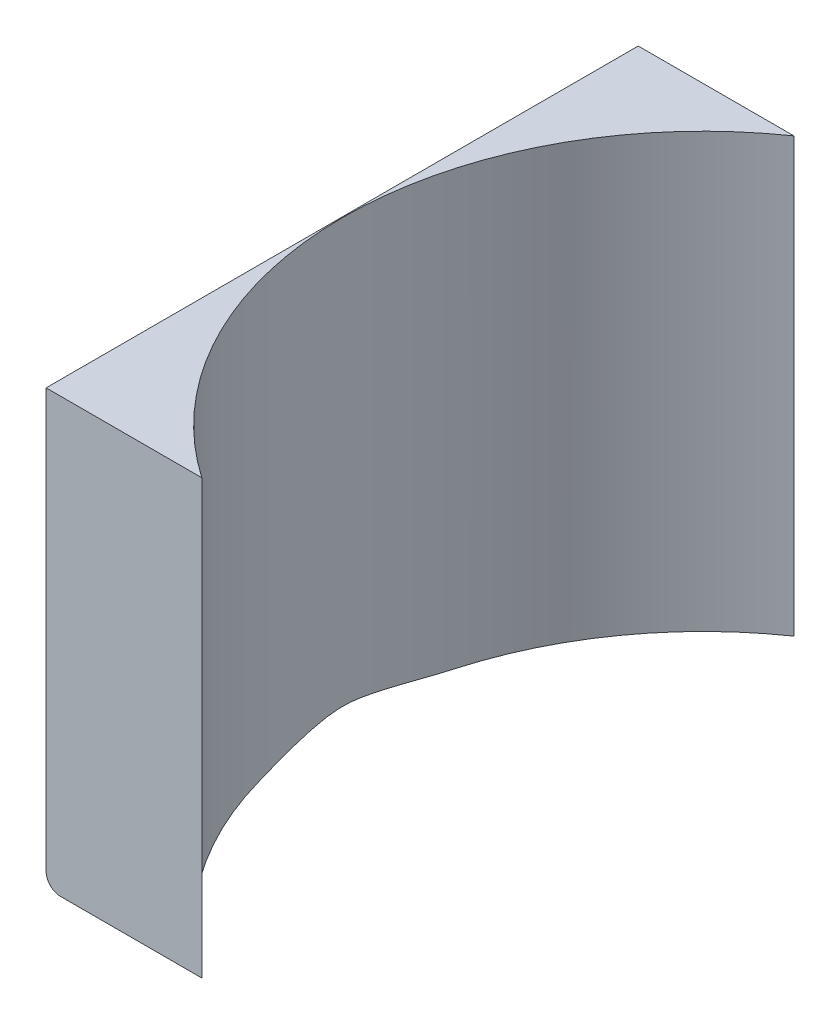
ISO-10303-21;
HEADER;
FILE_DESCRIPTION(('STEP AP214'),'2;1');
FILE_NAME('part.step','',(''),(''),'','','');
FILE_SCHEMA(('AUTOMOTIVE_DESIGN { 1 0 10303 214 1 1 1 1 }'));
ENDSEC;
DATA;
#1=APPLICATION_CONTEXT('core data for automotive mechanical design processes');
#2=APPLICATION_PROTOCOL_DEFINITION('international standard','automotive_design',2000,#1);
#3=PRODUCT_CONTEXT('',#1,'mechanical');
#4=PRODUCT('Part','Part','',(#3));
#5=PRODUCT_RELATED_PRODUCT_CATEGORY('part','',(#4));
#6=PRODUCT_DEFINITION_FORMATION('','',#4);
#7=PRODUCT_DEFINITION_CONTEXT('part definition',#1,'design');
#8=PRODUCT_DEFINITION('design','',#6,#7);
#9=PRODUCT_DEFINITION_SHAPE('','',#8);
#10=(LENGTH_UNIT() NAMED_UNIT(*) SI_UNIT(.MILLI.,.METRE.));
#11=(NAMED_UNIT(*) PLANE_ANGLE_UNIT() SI_UNIT($,.RADIAN.));
#12=(NAMED_UNIT(*) SI_UNIT($,.STERADIAN.) SOLID_ANGLE_UNIT());
#13=UNCERTAINTY_MEASURE_WITH_UNIT(LENGTH_MEASURE(1.E-05),#10,'distance_accuracy_value','');
#14=(GEOMETRIC_REPRESENTATION_CONTEXT(3) GLOBAL_UNCERTAINTY_ASSIGNED_CONTEXT((#13)) GLOBAL_UNIT_ASSIGNED_CONTEXT((#10,
#11,#12)) REPRESENTATION_CONTEXT('',''));
#15=CARTESIAN_POINT('',(0.,0.,0.));
#16=DIRECTION('',(0.,0.,1.));
#17=DIRECTION('',(1.,0.,0.));
#18=AXIS2_PLACEMENT_3D('',#15,#16,#17);
#19=CARTESIAN_POINT('',(0.,0.,0.));
#20=DIRECTION('',(0.,1.,0.));
#21=DIRECTION('',(0.,0.,1.));
#22=AXIS2_PLACEMENT_3D('',#19,#20,#21);
#23=PLANE('',#22);
#24=DIRECTION('',(-1.,0.,0.));
#25=VECTOR('',#24,1.);
#26=CARTESIAN_POINT('',(12.5,0.,-20.5));
#27=LINE('',#26,#25);
#28=CARTESIAN_POINT('',(-1.72155054837552,0.,-20.5));
#29=VERTEX_POINT('',#28);
#30=CARTESIAN_POINT('',(-11.5,0.,-20.5));
#31=VERTEX_POINT('',#30);
#32=EDGE_CURVE('E64',#29,#31,#27,.T.);
#33=ORIENTED_EDGE('',*,*,#32,.F.);
#34=CARTESIAN_POINT('',(12.5,0.,0.));
#35=DIRECTION('',(0.,1.,0.));
#36=DIRECTION('',(0.,0.,1.));
#37=AXIS2_PLACEMENT_3D('',#34,#35,#36);
#38=CIRCLE('',#37,24.95);
#39=CARTESIAN_POINT('',(-11.5,0.,-6.81927415492296));
#40=VERTEX_POINT('',#39);
#41=EDGE_CURVE('E93',#29,#40,#38,.T.);
#42=ORIENTED_EDGE('',*,*,#41,.T.);
#43=DIRECTION('',(0.,0.,1.));
#44=VECTOR('',#43,1.);
#45=CARTESIAN_POINT('',(-11.5,0.,0.));
#46=LINE('',#45,#44);
#47=EDGE_CURVE('E106',#40,#31,#46,.F.);
#48=ORIENTED_EDGE('',*,*,#47,.T.);
#49=EDGE_LOOP('',(#33,#42,#48));
#50=FACE_BOUND('',#49,.T.);
#51=ADVANCED_FACE('F36',(#50),#23,.F.);
#52=CARTESIAN_POINT('',(-12.5,30.,20.5));
#53=DIRECTION('',(1.,0.,0.));
#54=DIRECTION('',(0.,0.,-1.));
#55=AXIS2_PLACEMENT_3D('',#52,#53,#54);
#56=PLANE('',#55);
#57=DIRECTION('',(0.,-1.,0.));
#58=VECTOR('',#57,1.);
#59=CARTESIAN_POINT('',(-12.5,30.,-20.5));
#60=LINE('',#59,#58);
#61=CARTESIAN_POINT('',(-12.5,30.,-20.5));
#62=VERTEX_POINT('',#61);
#63=CARTESIAN_POINT('',(-12.5,1.,-20.5));
#64=VERTEX_POINT('',#63);
#65=EDGE_CURVE('E118',#62,#64,#60,.T.);
#66=ORIENTED_EDGE('',*,*,#65,.T.);
#67=DIRECTION('',(0.,0.,1.));
#68=VECTOR('',#67,1.);
#69=CARTESIAN_POINT('',(-12.5,1.,20.5));
#70=LINE('',#69,#68);
#71=CARTESIAN_POINT('',(-12.5,1.,20.5));
#72=VERTEX_POINT('',#71);
#73=EDGE_CURVE('E124',#64,#72,#70,.T.);
#74=ORIENTED_EDGE('',*,*,#73,.T.);
#75=DIRECTION('',(0.,-1.,0.));
#76=VECTOR('',#75,1.);
#77=CARTESIAN_POINT('',(-12.5,30.,20.5));
#78=LINE('',#77,#76);
#79=CARTESIAN_POINT('',(-12.5,30.,20.5));
#80=VERTEX_POINT('',#79);
#81=EDGE_CURVE('E121',#80,#72,#78,.T.);
#82=ORIENTED_EDGE('',*,*,#81,.F.);
#83=DIRECTION('',(0.,0.,1.));
#84=VECTOR('',#83,1.);
#85=CARTESIAN_POINT('',(-12.5,30.,20.5));
#86=LINE('',#85,#84);
#87=EDGE_CURVE('E108',#62,#80,#86,.T.);
#88=ORIENTED_EDGE('',*,*,#87,.F.);
#89=EDGE_LOOP('',(#66,#74,#82,#88));
#90=FACE_BOUND('',#89,.T.);
#91=ADVANCED_FACE('F135',(#90),#56,.F.);
#92=CARTESIAN_POINT('',(12.5,30.,20.5));
#93=DIRECTION('',(0.,0.,-1.));
#94=DIRECTION('',(-1.,0.,0.));
#95=AXIS2_PLACEMENT_3D('',#92,#93,#94);
#96=PLANE('',#95);
#97=DIRECTION('',(1.,0.,0.));
#98=VECTOR('',#97,1.);
#99=CARTESIAN_POINT('',(12.5,0.,20.5));
#100=LINE('',#99,#98);
#101=CARTESIAN_POINT('',(-11.5,0.,20.5));
#102=VERTEX_POINT('',#101);
#103=CARTESIAN_POINT('',(-1.72155054837554,0.,20.5));
#104=VERTEX_POINT('',#103);
#105=EDGE_CURVE('E109',#102,#104,#100,.T.);
#106=ORIENTED_EDGE('',*,*,#105,.T.);
#107=DIRECTION('',(0.,1.,0.));
#108=VECTOR('',#107,1.);
#109=CARTESIAN_POINT('',(-1.72155054837554,0.,20.5));
#110=LINE('',#109,#108);
#111=CARTESIAN_POINT('',(-1.72155054837554,30.,20.5));
#112=VERTEX_POINT('',#111);
#113=EDGE_CURVE('E104',#104,#112,#110,.T.);
#114=ORIENTED_EDGE('',*,*,#113,.T.);
#115=DIRECTION('',(1.,0.,0.));
#116=VECTOR('',#115,1.);
#117=CARTESIAN_POINT('',(12.5,30.,20.5));
#118=LINE('',#117,#116);
#119=EDGE_CURVE('E112',#80,#112,#118,.T.);
#120=ORIENTED_EDGE('',*,*,#119,.F.);
#121=ORIENTED_EDGE('',*,*,#81,.T.);
#122=CARTESIAN_POINT('',(-11.5,1.,20.5));
#123=DIRECTION('',(0.,0.,-1.));
#124=DIRECTION('',(-1.,0.,0.));
#125=AXIS2_PLACEMENT_3D('',#122,#123,#124);
#126=CIRCLE('',#125,1.);
#127=EDGE_CURVE('E127',#72,#102,#126,.F.);
#128=ORIENTED_EDGE('',*,*,#127,.T.);
#129=EDGE_LOOP('',(#106,#114,#120,#121,#128));
#130=FACE_BOUND('',#129,.T.);
#131=ADVANCED_FACE('F140',(#130),#96,.F.);
#132=CARTESIAN_POINT('',(12.5,30.,-20.5));
#133=DIRECTION('',(0.,0.,1.));
#134=DIRECTION('',(1.,0.,0.));
#135=AXIS2_PLACEMENT_3D('',#132,#133,#134);
#136=PLANE('',#135);
#137=DIRECTION('',(-1.,0.,0.));
#138=VECTOR('',#137,1.);
#139=CARTESIAN_POINT('',(12.5,30.,-20.5));
#140=LINE('',#139,#138);
#141=CARTESIAN_POINT('',(-1.72155054837552,30.,-20.5));
#142=VERTEX_POINT('',#141);
#143=EDGE_CURVE('E103',#142,#62,#140,.T.);
#144=ORIENTED_EDGE('',*,*,#143,.F.);
#145=DIRECTION('',(0.,1.,0.));
#146=VECTOR('',#145,1.);
#147=CARTESIAN_POINT('',(-1.72155054837552,0.,-20.5));
#148=LINE('',#147,#146);
#149=EDGE_CURVE('E95',#142,#29,#148,.F.);
#150=ORIENTED_EDGE('',*,*,#149,.T.);
#151=ORIENTED_EDGE('',*,*,#32,.T.);
#152=CARTESIAN_POINT('',(-11.5,1.,-20.5));
#153=DIRECTION('',(0.,0.,1.));
#154=DIRECTION('',(1.,0.,0.));
#155=AXIS2_PLACEMENT_3D('',#152,#153,#154);
#156=CIRCLE('',#155,1.);
#157=EDGE_CURVE('E50',#31,#64,#156,.F.);
#158=ORIENTED_EDGE('',*,*,#157,.T.);
#159=ORIENTED_EDGE('',*,*,#65,.F.);
#160=EDGE_LOOP('',(#144,#150,#151,#158,#159));
#161=FACE_BOUND('',#160,.T.);
#162=ADVANCED_FACE('F101',(#161),#136,.F.);
#163=CARTESIAN_POINT('',(0.,30.,0.));
#164=DIRECTION('',(0.,1.,0.));
#165=DIRECTION('',(0.,0.,1.));
#166=AXIS2_PLACEMENT_3D('',#163,#164,#165);
#167=PLANE('',#166);
#168=CARTESIAN_POINT('',(12.5,30.,0.));
#169=DIRECTION('',(0.,1.,0.));
#170=DIRECTION('',(0.,0.,1.));
#171=AXIS2_PLACEMENT_3D('',#168,#169,#170);
#172=CIRCLE('',#171,24.95);
#173=EDGE_CURVE('E144',#142,#112,#172,.T.);
#174=ORIENTED_EDGE('',*,*,#173,.F.);
#175=ORIENTED_EDGE('',*,*,#143,.T.);
#176=ORIENTED_EDGE('',*,*,#87,.T.);
#177=ORIENTED_EDGE('',*,*,#119,.T.);
#178=EDGE_LOOP('',(#174,#175,#176,#177));
#179=FACE_BOUND('',#178,.T.);
#180=ADVANCED_FACE('F150',(#179),#167,.T.);
#181=CARTESIAN_POINT('',(-11.5,0.,6.81927415492296));
#182=VERTEX_POINT('',#181);
#183=EDGE_CURVE('E129',#102,#182,#46,.F.);
#184=ORIENTED_EDGE('',*,*,#183,.T.);
#185=EDGE_CURVE('E56',#182,#104,#38,.T.);
#186=ORIENTED_EDGE('',*,*,#185,.T.);
#187=ORIENTED_EDGE('',*,*,#105,.F.);
#188=EDGE_LOOP('',(#184,#186,#187));
#189=FACE_BOUND('',#188,.T.);
#190=ADVANCED_FACE('F143',(#189),#23,.F.);
#191=CARTESIAN_POINT('',(-11.5,1.,20.5));
#192=DIRECTION('',(0.,0.,1.));
#193=DIRECTION('',(1.,0.,0.));
#194=AXIS2_PLACEMENT_3D('',#191,#192,#193);
#195=CYLINDRICAL_SURFACE('',#194,1.);
#196=CARTESIAN_POINT('',(-11.5,0.,6.81927415492296));
#197=CARTESIAN_POINT('',(-11.5457732983895,4.19109116719665E-05,6.65818263210462));
#198=CARTESIAN_POINT('',(-11.5899105626056,0.00313718969765501,6.49667047038361));
#199=CARTESIAN_POINT('',(-11.6748711429704,0.0144676332201106,6.17301172480707));
#200=CARTESIAN_POINT('',(-11.7156956146173,0.022700997014768,6.0108653830175));
#201=CARTESIAN_POINT('',(-11.8329934492836,0.0536126443049659,5.5244033685815));
#202=CARTESIAN_POINT('',(-11.9045134427951,0.0825120988208896,5.19928197341116));
#203=CARTESIAN_POINT('',(-12.0300320609709,0.149254369045573,4.56907130850546));
#204=CARTESIAN_POINT('',(-12.084872734357,0.186385472854514,4.26406822369236));
#205=CARTESIAN_POINT('',(-12.1830728053806,0.266903790794347,3.65297303550817));
#206=CARTESIAN_POINT('',(-12.2264295282701,0.310292458757808,3.34688069523113));
#207=CARTESIAN_POINT('',(-12.2829064307552,0.377172928712937,2.88685626398407));
#208=CARTESIAN_POINT('',(-12.3003111289144,0.399775720813323,2.73330341906113));
#209=CARTESIAN_POINT('',(-12.3322655974969,0.444935034705895,2.42589491954099));
#210=CARTESIAN_POINT('',(-12.3468154381606,0.467491557622964,2.27203927248798));
#211=CARTESIAN_POINT('',(-12.3730590505528,0.511708881529116,1.96400615082411));
#212=CARTESIAN_POINT('',(-12.3847537307286,0.533369965599532,1.8098287943619));
#213=CARTESIAN_POINT('',(-12.4052890310887,0.574583560624603,1.50100822613499));
#214=CARTESIAN_POINT('',(-12.414129924682,0.594136273453602,1.34636506043112));
#215=CARTESIAN_POINT('',(-12.4263321459197,0.623085849142543,1.09112089503728));
#216=CARTESIAN_POINT('',(-12.4305263852323,0.63363262559979,0.990692632531398));
#217=CARTESIAN_POINT('',(-12.4377065739978,0.652430675867184,0.7895718211807));
#218=CARTESIAN_POINT('',(-12.4406924219893,0.660681756903115,0.688879250857638));
#219=CARTESIAN_POINT('',(-12.4478119433998,0.680816167111608,0.386840215600974));
#220=CARTESIAN_POINT('',(-12.4501287384151,0.688137069742008,0.185091638313497));
#221=CARTESIAN_POINT('',(-12.4498661088151,0.687347246399775,-0.209440839261772));
#222=CARTESIAN_POINT('',(-12.447498490006,0.679904040999444,-0.402226987109895));
#223=CARTESIAN_POINT('',(-12.4383285808258,0.654020721582922,-0.786998615243157));
#224=CARTESIAN_POINT('',(-12.4315231788955,0.635572892429963,-0.978983438553836));
#225=CARTESIAN_POINT('',(-12.4135098680592,0.592511915836431,-1.36252906981458));
#226=CARTESIAN_POINT('',(-12.4022901754228,0.567882330752974,-1.55408735120079));
#227=CARTESIAN_POINT('',(-12.3754768691812,0.515851150493839,-1.93645817304113));
#228=CARTESIAN_POINT('',(-12.3598843649432,0.488450259514714,-2.12727089020948));
#229=CARTESIAN_POINT('',(-12.3241956627555,0.432719560358191,-2.50977490337278));
#230=CARTESIAN_POINT('',(-12.3040673968964,0.404384428574507,-2.70146243482344));
#231=CARTESIAN_POINT('',(-12.2593629895779,0.348344379208924,-3.08441419067172));
#232=CARTESIAN_POINT('',(-12.2347865864743,0.320639498807056,-3.27567838949823));
#233=CARTESIAN_POINT('',(-12.1544343375143,0.240091229088246,-3.84835528273055));
#234=CARTESIAN_POINT('',(-12.0919810564746,0.189722367560194,-4.22923581843728));
#235=CARTESIAN_POINT('',(-11.985693966563,0.124916091872307,-4.79467522724649));
#236=CARTESIAN_POINT('',(-11.9486891129527,0.105282349795293,-4.97994637789715));
#237=CARTESIAN_POINT('',(-11.8703858710218,0.0701310749394397,-5.35000607646716));
#238=CARTESIAN_POINT('',(-11.8290869502402,0.0546140534801545,-5.53479456161711));
#239=CARTESIAN_POINT('',(-11.7422882383097,0.028740336755059,-5.90336580015901));
#240=CARTESIAN_POINT('',(-11.6967970866652,0.0183732981850687,-6.08714983023958));
#241=CARTESIAN_POINT('',(-11.6253785585989,0.00759933789655947,-6.36219977229538));
#242=CARTESIAN_POINT('',(-11.6010394556364,0.0048040762665176,-6.45378798219596));
#243=CARTESIAN_POINT('',(-11.5513076038181,0.00100677192785223,-6.63672280486647));
#244=CARTESIAN_POINT('',(-11.525914766412,4.880238336653E-06,-6.72806939664313));
#245=CARTESIAN_POINT('',(-11.5,0.,-6.81927415492296));
#246=B_SPLINE_CURVE_WITH_KNOTS('',3,(#196,#197,#198,#199,#200,#201,#202,#203,#204,#205,#206,
#207,#208,#209,#210,#211,#212,#213,#214,#215,#216,#217,#218,#219,#220,#221,#222,#223,#224,#225,
#226,#227,#228,#229,#230,#231,#232,#233,#234,#235,#236,#237,#238,#239,#240,#241,#242,#243,#244,
#245),.UNSPECIFIED.,.F.,.F.,(4,2,2,2,2,2,2,2,2,2,2,2,2,2,2,2,2,2,2,2,2,2,2,2,4),(0.,
0.50230435383348,1.00443274459607,2.00625342378128,2.94230254401946,3.87856948983737,
4.34709081453548,4.81560061037875,5.28396114221771,5.75227678912969,6.05544968798655,
6.3586480372103,6.96371212054758,7.5420428075131,8.12077942866252,8.70107155639483,
9.28121659898684,9.86559966760709,10.450017121443,11.6170739414819,12.1868456052857,
12.7566880047969,13.3253812497215,13.6097854997717,13.8942136982862),.UNSPECIFIED.);
#247=EDGE_CURVE('E11',#182,#40,#246,.T.);
#248=ORIENTED_EDGE('',*,*,#247,.F.);
#249=ORIENTED_EDGE('',*,*,#183,.F.);
#250=ORIENTED_EDGE('',*,*,#127,.F.);
#251=ORIENTED_EDGE('',*,*,#73,.F.);
#252=ORIENTED_EDGE('',*,*,#157,.F.);
#253=ORIENTED_EDGE('',*,*,#47,.F.);
#254=EDGE_LOOP('',(#248,#249,#250,#251,#252,#253));
#255=FACE_BOUND('',#254,.T.);
#256=ADVANCED_FACE('F38',(#255),#195,.T.);
#257=CARTESIAN_POINT('',(12.5,0.,0.));
#258=DIRECTION('',(0.,1.,0.));
#259=DIRECTION('',(0.,0.,1.));
#260=AXIS2_PLACEMENT_3D('',#257,#258,#259);
#261=CYLINDRICAL_SURFACE('',#260,24.95);
#262=ORIENTED_EDGE('',*,*,#185,.F.);
#263=ORIENTED_EDGE('',*,*,#247,.T.);
#264=ORIENTED_EDGE('',*,*,#41,.F.);
#265=ORIENTED_EDGE('',*,*,#149,.F.);
#266=ORIENTED_EDGE('',*,*,#173,.T.);
#267=ORIENTED_EDGE('',*,*,#113,.F.);
#268=EDGE_LOOP('',(#262,#263,#264,#265,#266,#267));
#269=FACE_BOUND('',#268,.T.);
#270=ADVANCED_FACE('F94',(#269),#261,.F.);
#271=CLOSED_SHELL('',(#51,#91,#131,#162,#180,#190,#256,#270));
#272=MANIFOLD_SOLID_BREP('B2',#271);
#273=ADVANCED_BREP_SHAPE_REPRESENTATION('',(#18,#272),#14);
#274=SHAPE_DEFINITION_REPRESENTATION(#9,#273);
ENDSEC;
END-ISO-10303-21;
